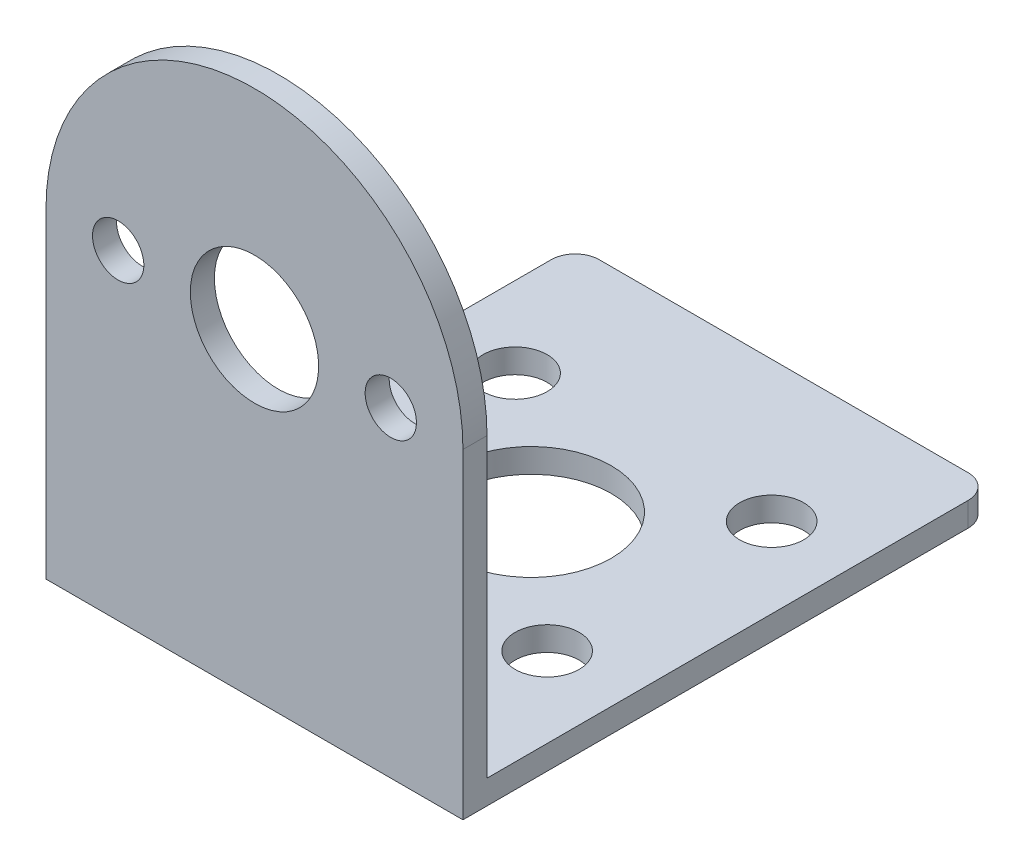
ISO-10303-21;
HEADER;
FILE_DESCRIPTION(('STEP AP214'),'2;1');
FILE_NAME('part.step','',(''),(''),'','','');
FILE_SCHEMA(('AUTOMOTIVE_DESIGN { 1 0 10303 214 1 1 1 1 }'));
ENDSEC;
DATA;
#1=APPLICATION_CONTEXT('core data for automotive mechanical design processes');
#2=APPLICATION_PROTOCOL_DEFINITION('international standard','automotive_design',2000,#1);
#3=PRODUCT_CONTEXT('',#1,'mechanical');
#4=PRODUCT('Part','Part','',(#3));
#5=PRODUCT_RELATED_PRODUCT_CATEGORY('part','',(#4));
#6=PRODUCT_DEFINITION_FORMATION('','',#4);
#7=PRODUCT_DEFINITION_CONTEXT('part definition',#1,'design');
#8=PRODUCT_DEFINITION('design','',#6,#7);
#9=PRODUCT_DEFINITION_SHAPE('','',#8);
#10=(LENGTH_UNIT() NAMED_UNIT(*) SI_UNIT(.MILLI.,.METRE.));
#11=(NAMED_UNIT(*) PLANE_ANGLE_UNIT() SI_UNIT($,.RADIAN.));
#12=(NAMED_UNIT(*) SI_UNIT($,.STERADIAN.) SOLID_ANGLE_UNIT());
#13=UNCERTAINTY_MEASURE_WITH_UNIT(LENGTH_MEASURE(1.E-05),#10,'distance_accuracy_value','');
#14=(GEOMETRIC_REPRESENTATION_CONTEXT(3) GLOBAL_UNCERTAINTY_ASSIGNED_CONTEXT((#13)) GLOBAL_UNIT_ASSIGNED_CONTEXT((#10,
#11,#12)) REPRESENTATION_CONTEXT('',''));
#15=CARTESIAN_POINT('',(0.,0.,0.));
#16=DIRECTION('',(0.,0.,1.));
#17=DIRECTION('',(1.,0.,0.));
#18=AXIS2_PLACEMENT_3D('',#15,#16,#17);
#19=CARTESIAN_POINT('',(13.,20.,0.));
#20=DIRECTION('',(0.,0.,1.));
#21=DIRECTION('',(1.,0.,0.));
#22=AXIS2_PLACEMENT_3D('',#19,#20,#21);
#23=PLANE('',#22);
#24=CARTESIAN_POINT('',(13.,20.,0.));
#25=DIRECTION('',(0.,0.,-1.));
#26=DIRECTION('',(-1.,0.,0.));
#27=AXIS2_PLACEMENT_3D('',#24,#25,#26);
#28=CIRCLE('',#27,4.);
#29=CARTESIAN_POINT('',(9.,20.,0.));
#30=VERTEX_POINT('',#29);
#31=EDGE_CURVE('E128',#30,#30,#28,.T.);
#32=ORIENTED_EDGE('',*,*,#31,.F.);
#33=EDGE_LOOP('',(#32));
#34=FACE_BOUND('',#33,.T.);
#35=CARTESIAN_POINT('',(4.5,20.,0.));
#36=DIRECTION('',(0.,0.,-1.));
#37=DIRECTION('',(-1.,0.,0.));
#38=AXIS2_PLACEMENT_3D('',#35,#36,#37);
#39=CIRCLE('',#38,1.6);
#40=CARTESIAN_POINT('',(2.9,20.,0.));
#41=VERTEX_POINT('',#40);
#42=EDGE_CURVE('E138',#41,#41,#39,.T.);
#43=ORIENTED_EDGE('',*,*,#42,.F.);
#44=EDGE_LOOP('',(#43));
#45=FACE_BOUND('',#44,.T.);
#46=CARTESIAN_POINT('',(21.5,20.,0.));
#47=DIRECTION('',(0.,0.,-1.));
#48=DIRECTION('',(-1.,0.,0.));
#49=AXIS2_PLACEMENT_3D('',#46,#47,#48);
#50=CIRCLE('',#49,1.6);
#51=CARTESIAN_POINT('',(19.9,20.,0.));
#52=VERTEX_POINT('',#51);
#53=EDGE_CURVE('E132',#52,#52,#50,.T.);
#54=ORIENTED_EDGE('',*,*,#53,.F.);
#55=EDGE_LOOP('',(#54));
#56=FACE_BOUND('',#55,.T.);
#57=DIRECTION('',(1.,0.,0.));
#58=VECTOR('',#57,1.);
#59=CARTESIAN_POINT('',(26.,1.5,0.));
#60=LINE('',#59,#58);
#61=CARTESIAN_POINT('',(0.,1.5,0.));
#62=VERTEX_POINT('',#61);
#63=CARTESIAN_POINT('',(26.,1.5,0.));
#64=VERTEX_POINT('',#63);
#65=EDGE_CURVE('E111',#62,#64,#60,.T.);
#66=ORIENTED_EDGE('',*,*,#65,.F.);
#67=DIRECTION('',(0.,-1.,0.));
#68=VECTOR('',#67,1.);
#69=CARTESIAN_POINT('',(0.,0.,0.));
#70=LINE('',#69,#68);
#71=CARTESIAN_POINT('',(0.,20.,0.));
#72=VERTEX_POINT('',#71);
#73=EDGE_CURVE('E114',#72,#62,#70,.T.);
#74=ORIENTED_EDGE('',*,*,#73,.F.);
#75=CARTESIAN_POINT('',(13.,20.,0.));
#76=DIRECTION('',(0.,0.,1.));
#77=DIRECTION('',(1.,0.,0.));
#78=AXIS2_PLACEMENT_3D('',#75,#76,#77);
#79=CIRCLE('',#78,13.);
#80=CARTESIAN_POINT('',(26.,20.,0.));
#81=VERTEX_POINT('',#80);
#82=EDGE_CURVE('E113',#81,#72,#79,.T.);
#83=ORIENTED_EDGE('',*,*,#82,.F.);
#84=DIRECTION('',(0.,1.,0.));
#85=VECTOR('',#84,1.);
#86=CARTESIAN_POINT('',(26.,0.,0.));
#87=LINE('',#86,#85);
#88=EDGE_CURVE('E100',#64,#81,#87,.T.);
#89=ORIENTED_EDGE('',*,*,#88,.F.);
#90=EDGE_LOOP('',(#66,#74,#83,#89));
#91=FACE_BOUND('',#90,.T.);
#92=ADVANCED_FACE('F34',(#34,#45,#56,#91),#23,.F.);
#93=CARTESIAN_POINT('',(0.,0.,1.5));
#94=DIRECTION('',(1.,0.,0.));
#95=DIRECTION('',(0.,0.,-1.));
#96=AXIS2_PLACEMENT_3D('',#93,#94,#95);
#97=PLANE('',#96);
#98=DIRECTION('',(0.,0.,1.));
#99=VECTOR('',#98,1.);
#100=CARTESIAN_POINT('',(0.,1.5,-31.5));
#101=LINE('',#100,#99);
#102=CARTESIAN_POINT('',(0.,1.5,-30.));
#103=VERTEX_POINT('',#102);
#104=EDGE_CURVE('E104',#103,#62,#101,.T.);
#105=ORIENTED_EDGE('',*,*,#104,.F.);
#106=DIRECTION('',(0.,1.,0.));
#107=VECTOR('',#106,1.);
#108=CARTESIAN_POINT('',(0.,0.,-30.));
#109=LINE('',#108,#107);
#110=CARTESIAN_POINT('',(0.,0.,-30.));
#111=VERTEX_POINT('',#110);
#112=EDGE_CURVE('E11',#103,#111,#109,.F.);
#113=ORIENTED_EDGE('',*,*,#112,.T.);
#114=DIRECTION('',(0.,0.,-1.));
#115=VECTOR('',#114,1.);
#116=CARTESIAN_POINT('',(0.,0.,1.5));
#117=LINE('',#116,#115);
#118=CARTESIAN_POINT('',(0.,0.,1.5));
#119=VERTEX_POINT('',#118);
#120=EDGE_CURVE('E164',#119,#111,#117,.T.);
#121=ORIENTED_EDGE('',*,*,#120,.F.);
#122=DIRECTION('',(0.,-1.,0.));
#123=VECTOR('',#122,1.);
#124=CARTESIAN_POINT('',(0.,0.,1.5));
#125=LINE('',#124,#123);
#126=CARTESIAN_POINT('',(0.,20.,1.5));
#127=VERTEX_POINT('',#126);
#128=EDGE_CURVE('E146',#127,#119,#125,.T.);
#129=ORIENTED_EDGE('',*,*,#128,.F.);
#130=DIRECTION('',(0.,0.,-1.));
#131=VECTOR('',#130,1.);
#132=CARTESIAN_POINT('',(0.,20.,1.5));
#133=LINE('',#132,#131);
#134=EDGE_CURVE('E155',#127,#72,#133,.T.);
#135=ORIENTED_EDGE('',*,*,#134,.T.);
#136=ORIENTED_EDGE('',*,*,#73,.T.);
#137=EDGE_LOOP('',(#105,#113,#121,#129,#135,#136));
#138=FACE_BOUND('',#137,.T.);
#139=ADVANCED_FACE('F212',(#138),#97,.F.);
#140=CARTESIAN_POINT('',(0.,0.,1.5));
#141=DIRECTION('',(0.,1.,0.));
#142=DIRECTION('',(0.,0.,1.));
#143=AXIS2_PLACEMENT_3D('',#140,#141,#142);
#144=PLANE('',#143);
#145=CARTESIAN_POINT('',(5.,0.,-22.75));
#146=DIRECTION('',(0.,-1.,0.));
#147=DIRECTION('',(0.,0.,1.));
#148=AXIS2_PLACEMENT_3D('',#145,#146,#147);
#149=CIRCLE('',#148,2.);
#150=CARTESIAN_POINT('',(5.,0.,-20.75));
#151=VERTEX_POINT('',#150);
#152=EDGE_CURVE('E292',#151,#151,#149,.T.);
#153=ORIENTED_EDGE('',*,*,#152,.F.);
#154=EDGE_LOOP('',(#153));
#155=FACE_BOUND('',#154,.T.);
#156=CARTESIAN_POINT('',(13.,0.,-15.75));
#157=DIRECTION('',(0.,-1.,0.));
#158=DIRECTION('',(0.,0.,-1.));
#159=AXIS2_PLACEMENT_3D('',#156,#157,#158);
#160=CIRCLE('',#159,5.);
#161=CARTESIAN_POINT('',(13.,0.,-20.75));
#162=VERTEX_POINT('',#161);
#163=EDGE_CURVE('E287',#162,#162,#160,.T.);
#164=ORIENTED_EDGE('',*,*,#163,.F.);
#165=EDGE_LOOP('',(#164));
#166=FACE_BOUND('',#165,.T.);
#167=CARTESIAN_POINT('',(21.,0.,-22.75));
#168=DIRECTION('',(0.,-1.,0.));
#169=DIRECTION('',(0.,0.,1.));
#170=AXIS2_PLACEMENT_3D('',#167,#168,#169);
#171=CIRCLE('',#170,2.);
#172=CARTESIAN_POINT('',(21.,0.,-20.75));
#173=VERTEX_POINT('',#172);
#174=EDGE_CURVE('E282',#173,#173,#171,.T.);
#175=ORIENTED_EDGE('',*,*,#174,.F.);
#176=EDGE_LOOP('',(#175));
#177=FACE_BOUND('',#176,.T.);
#178=CARTESIAN_POINT('',(21.,0.,-8.75));
#179=DIRECTION('',(0.,-1.,0.));
#180=DIRECTION('',(0.,0.,-1.));
#181=AXIS2_PLACEMENT_3D('',#178,#179,#180);
#182=CIRCLE('',#181,2.);
#183=CARTESIAN_POINT('',(21.,0.,-10.75));
#184=VERTEX_POINT('',#183);
#185=EDGE_CURVE('E275',#184,#184,#182,.T.);
#186=ORIENTED_EDGE('',*,*,#185,.F.);
#187=EDGE_LOOP('',(#186));
#188=FACE_BOUND('',#187,.T.);
#189=CARTESIAN_POINT('',(5.,0.,-8.75));
#190=DIRECTION('',(0.,-1.,0.));
#191=DIRECTION('',(0.,0.,-1.));
#192=AXIS2_PLACEMENT_3D('',#189,#190,#191);
#193=CIRCLE('',#192,2.);
#194=CARTESIAN_POINT('',(5.,0.,-10.75));
#195=VERTEX_POINT('',#194);
#196=EDGE_CURVE('E172',#195,#195,#193,.T.);
#197=ORIENTED_EDGE('',*,*,#196,.F.);
#198=EDGE_LOOP('',(#197));
#199=FACE_BOUND('',#198,.T.);
#200=DIRECTION('',(-1.,0.,0.));
#201=VECTOR('',#200,1.);
#202=CARTESIAN_POINT('',(26.,0.,-31.5));
#203=LINE('',#202,#201);
#204=CARTESIAN_POINT('',(24.5,0.,-31.5));
#205=VERTEX_POINT('',#204);
#206=CARTESIAN_POINT('',(1.5,0.,-31.5));
#207=VERTEX_POINT('',#206);
#208=EDGE_CURVE('E117',#205,#207,#203,.T.);
#209=ORIENTED_EDGE('',*,*,#208,.F.);
#210=CARTESIAN_POINT('',(24.5,0.,-30.));
#211=DIRECTION('',(0.,1.,0.));
#212=DIRECTION('',(0.,0.,1.));
#213=AXIS2_PLACEMENT_3D('',#210,#211,#212);
#214=CIRCLE('',#213,1.5);
#215=CARTESIAN_POINT('',(26.,0.,-30.));
#216=VERTEX_POINT('',#215);
#217=EDGE_CURVE('E187',#205,#216,#214,.F.);
#218=ORIENTED_EDGE('',*,*,#217,.T.);
#219=DIRECTION('',(0.,0.,-1.));
#220=VECTOR('',#219,1.);
#221=CARTESIAN_POINT('',(26.,0.,1.5));
#222=LINE('',#221,#220);
#223=CARTESIAN_POINT('',(26.,0.,1.5));
#224=VERTEX_POINT('',#223);
#225=EDGE_CURVE('E162',#224,#216,#222,.T.);
#226=ORIENTED_EDGE('',*,*,#225,.F.);
#227=DIRECTION('',(1.,0.,0.));
#228=VECTOR('',#227,1.);
#229=CARTESIAN_POINT('',(0.,0.,1.5));
#230=LINE('',#229,#228);
#231=EDGE_CURVE('E149',#119,#224,#230,.T.);
#232=ORIENTED_EDGE('',*,*,#231,.F.);
#233=ORIENTED_EDGE('',*,*,#120,.T.);
#234=CARTESIAN_POINT('',(1.5,0.,-30.));
#235=DIRECTION('',(0.,1.,0.));
#236=DIRECTION('',(0.,0.,1.));
#237=AXIS2_PLACEMENT_3D('',#234,#235,#236);
#238=CIRCLE('',#237,1.5);
#239=EDGE_CURVE('E185',#111,#207,#238,.F.);
#240=ORIENTED_EDGE('',*,*,#239,.T.);
#241=EDGE_LOOP('',(#209,#218,#226,#232,#233,#240));
#242=FACE_BOUND('',#241,.T.);
#243=ADVANCED_FACE('F200',(#155,#166,#177,#188,#199,#242),#144,.F.);
#244=CARTESIAN_POINT('',(26.,0.,1.5));
#245=DIRECTION('',(-1.,0.,0.));
#246=DIRECTION('',(0.,0.,1.));
#247=AXIS2_PLACEMENT_3D('',#244,#245,#246);
#248=PLANE('',#247);
#249=ORIENTED_EDGE('',*,*,#225,.T.);
#250=DIRECTION('',(0.,-1.,0.));
#251=VECTOR('',#250,1.);
#252=CARTESIAN_POINT('',(26.,0.,-30.));
#253=LINE('',#252,#251);
#254=CARTESIAN_POINT('',(26.,1.5,-30.));
#255=VERTEX_POINT('',#254);
#256=EDGE_CURVE('E57',#216,#255,#253,.F.);
#257=ORIENTED_EDGE('',*,*,#256,.T.);
#258=DIRECTION('',(0.,0.,1.));
#259=VECTOR('',#258,1.);
#260=CARTESIAN_POINT('',(26.,1.5,-31.5));
#261=LINE('',#260,#259);
#262=EDGE_CURVE('E96',#255,#64,#261,.T.);
#263=ORIENTED_EDGE('',*,*,#262,.T.);
#264=ORIENTED_EDGE('',*,*,#88,.T.);
#265=DIRECTION('',(0.,0.,-1.));
#266=VECTOR('',#265,1.);
#267=CARTESIAN_POINT('',(26.,20.,1.5));
#268=LINE('',#267,#266);
#269=CARTESIAN_POINT('',(26.,20.,1.5));
#270=VERTEX_POINT('',#269);
#271=EDGE_CURVE('E160',#270,#81,#268,.T.);
#272=ORIENTED_EDGE('',*,*,#271,.F.);
#273=DIRECTION('',(0.,1.,0.));
#274=VECTOR('',#273,1.);
#275=CARTESIAN_POINT('',(26.,0.,1.5));
#276=LINE('',#275,#274);
#277=EDGE_CURVE('E151',#224,#270,#276,.T.);
#278=ORIENTED_EDGE('',*,*,#277,.F.);
#279=EDGE_LOOP('',(#249,#257,#263,#264,#272,#278));
#280=FACE_BOUND('',#279,.T.);
#281=ADVANCED_FACE('F98',(#280),#248,.F.);
#282=CARTESIAN_POINT('',(13.,20.,1.5));
#283=DIRECTION('',(0.,0.,-1.));
#284=DIRECTION('',(-1.,0.,0.));
#285=AXIS2_PLACEMENT_3D('',#282,#283,#284);
#286=CYLINDRICAL_SURFACE('',#285,13.);
#287=ORIENTED_EDGE('',*,*,#82,.T.);
#288=ORIENTED_EDGE('',*,*,#134,.F.);
#289=CARTESIAN_POINT('',(13.,20.,1.5));
#290=DIRECTION('',(0.,0.,1.));
#291=DIRECTION('',(1.,0.,0.));
#292=AXIS2_PLACEMENT_3D('',#289,#290,#291);
#293=CIRCLE('',#292,13.);
#294=EDGE_CURVE('E153',#270,#127,#293,.T.);
#295=ORIENTED_EDGE('',*,*,#294,.F.);
#296=ORIENTED_EDGE('',*,*,#271,.T.);
#297=EDGE_LOOP('',(#287,#288,#295,#296));
#298=FACE_BOUND('',#297,.T.);
#299=ADVANCED_FACE('F214',(#298),#286,.T.);
#300=CARTESIAN_POINT('',(13.,20.,1.5));
#301=DIRECTION('',(0.,0.,1.));
#302=DIRECTION('',(1.,0.,0.));
#303=AXIS2_PLACEMENT_3D('',#300,#301,#302);
#304=PLANE('',#303);
#305=CARTESIAN_POINT('',(21.5,20.,1.5));
#306=DIRECTION('',(0.,0.,-1.));
#307=DIRECTION('',(-1.,0.,0.));
#308=AXIS2_PLACEMENT_3D('',#305,#306,#307);
#309=CIRCLE('',#308,1.6);
#310=CARTESIAN_POINT('',(19.9,20.,1.5));
#311=VERTEX_POINT('',#310);
#312=EDGE_CURVE('E129',#311,#311,#309,.T.);
#313=ORIENTED_EDGE('',*,*,#312,.T.);
#314=EDGE_LOOP('',(#313));
#315=FACE_BOUND('',#314,.T.);
#316=CARTESIAN_POINT('',(4.5,20.,1.5));
#317=DIRECTION('',(0.,0.,-1.));
#318=DIRECTION('',(-1.,0.,0.));
#319=AXIS2_PLACEMENT_3D('',#316,#317,#318);
#320=CIRCLE('',#319,1.6);
#321=CARTESIAN_POINT('',(2.9,20.,1.5));
#322=VERTEX_POINT('',#321);
#323=EDGE_CURVE('E135',#322,#322,#320,.T.);
#324=ORIENTED_EDGE('',*,*,#323,.T.);
#325=EDGE_LOOP('',(#324));
#326=FACE_BOUND('',#325,.T.);
#327=CARTESIAN_POINT('',(13.,20.,1.5));
#328=DIRECTION('',(0.,0.,-1.));
#329=DIRECTION('',(-1.,0.,0.));
#330=AXIS2_PLACEMENT_3D('',#327,#328,#329);
#331=CIRCLE('',#330,4.);
#332=CARTESIAN_POINT('',(9.,20.,1.5));
#333=VERTEX_POINT('',#332);
#334=EDGE_CURVE('E141',#333,#333,#331,.T.);
#335=ORIENTED_EDGE('',*,*,#334,.T.);
#336=EDGE_LOOP('',(#335));
#337=FACE_BOUND('',#336,.T.);
#338=ORIENTED_EDGE('',*,*,#128,.T.);
#339=ORIENTED_EDGE('',*,*,#231,.T.);
#340=ORIENTED_EDGE('',*,*,#277,.T.);
#341=ORIENTED_EDGE('',*,*,#294,.T.);
#342=EDGE_LOOP('',(#338,#339,#340,#341));
#343=FACE_BOUND('',#342,.T.);
#344=ADVANCED_FACE('F204',(#315,#326,#337,#343),#304,.T.);
#345=CARTESIAN_POINT('',(13.,20.,1.5));
#346=DIRECTION('',(0.,0.,-1.));
#347=DIRECTION('',(-1.,0.,0.));
#348=AXIS2_PLACEMENT_3D('',#345,#346,#347);
#349=CYLINDRICAL_SURFACE('',#348,4.);
#350=ORIENTED_EDGE('',*,*,#334,.F.);
#351=EDGE_LOOP('',(#350));
#352=FACE_BOUND('',#351,.T.);
#353=ORIENTED_EDGE('',*,*,#31,.T.);
#354=EDGE_LOOP('',(#353));
#355=FACE_BOUND('',#354,.T.);
#356=ADVANCED_FACE('F221',(#352,#355),#349,.F.);
#357=CARTESIAN_POINT('',(4.5,20.,1.5));
#358=DIRECTION('',(0.,0.,-1.));
#359=DIRECTION('',(-1.,0.,0.));
#360=AXIS2_PLACEMENT_3D('',#357,#358,#359);
#361=CYLINDRICAL_SURFACE('',#360,1.6);
#362=ORIENTED_EDGE('',*,*,#323,.F.);
#363=EDGE_LOOP('',(#362));
#364=FACE_BOUND('',#363,.T.);
#365=ORIENTED_EDGE('',*,*,#42,.T.);
#366=EDGE_LOOP('',(#365));
#367=FACE_BOUND('',#366,.T.);
#368=ADVANCED_FACE('F237',(#364,#367),#361,.F.);
#369=CARTESIAN_POINT('',(21.5,20.,1.5));
#370=DIRECTION('',(0.,0.,-1.));
#371=DIRECTION('',(-1.,0.,0.));
#372=AXIS2_PLACEMENT_3D('',#369,#370,#371);
#373=CYLINDRICAL_SURFACE('',#372,1.6);
#374=ORIENTED_EDGE('',*,*,#312,.F.);
#375=EDGE_LOOP('',(#374));
#376=FACE_BOUND('',#375,.T.);
#377=ORIENTED_EDGE('',*,*,#53,.T.);
#378=EDGE_LOOP('',(#377));
#379=FACE_BOUND('',#378,.T.);
#380=ADVANCED_FACE('F241',(#376,#379),#373,.F.);
#381=CARTESIAN_POINT('',(26.,1.5,-31.5));
#382=DIRECTION('',(0.,-1.,0.));
#383=DIRECTION('',(1.,0.,0.));
#384=AXIS2_PLACEMENT_3D('',#381,#382,#383);
#385=PLANE('',#384);
#386=CARTESIAN_POINT('',(5.,1.5,-22.75));
#387=DIRECTION('',(0.,-1.,0.));
#388=DIRECTION('',(1.,0.,0.));
#389=AXIS2_PLACEMENT_3D('',#386,#387,#388);
#390=CIRCLE('',#389,2.);
#391=CARTESIAN_POINT('',(7.,1.5,-22.75));
#392=VERTEX_POINT('',#391);
#393=EDGE_CURVE('E118',#392,#392,#390,.T.);
#394=ORIENTED_EDGE('',*,*,#393,.T.);
#395=EDGE_LOOP('',(#394));
#396=FACE_BOUND('',#395,.T.);
#397=CARTESIAN_POINT('',(13.,1.5,-15.75));
#398=DIRECTION('',(0.,-1.,0.));
#399=DIRECTION('',(1.,0.,0.));
#400=AXIS2_PLACEMENT_3D('',#397,#398,#399);
#401=CIRCLE('',#400,5.);
#402=CARTESIAN_POINT('',(18.,1.5,-15.75));
#403=VERTEX_POINT('',#402);
#404=EDGE_CURVE('E123',#403,#403,#401,.T.);
#405=ORIENTED_EDGE('',*,*,#404,.T.);
#406=EDGE_LOOP('',(#405));
#407=FACE_BOUND('',#406,.T.);
#408=CARTESIAN_POINT('',(21.,1.5,-22.75));
#409=DIRECTION('',(0.,-1.,0.));
#410=DIRECTION('',(1.,0.,0.));
#411=AXIS2_PLACEMENT_3D('',#408,#409,#410);
#412=CIRCLE('',#411,2.);
#413=CARTESIAN_POINT('',(23.,1.5,-22.75));
#414=VERTEX_POINT('',#413);
#415=EDGE_CURVE('E175',#414,#414,#412,.T.);
#416=ORIENTED_EDGE('',*,*,#415,.T.);
#417=EDGE_LOOP('',(#416));
#418=FACE_BOUND('',#417,.T.);
#419=CARTESIAN_POINT('',(21.,1.5,-8.75));
#420=DIRECTION('',(0.,-1.,0.));
#421=DIRECTION('',(1.,0.,0.));
#422=AXIS2_PLACEMENT_3D('',#419,#420,#421);
#423=CIRCLE('',#422,2.);
#424=CARTESIAN_POINT('',(23.,1.5,-8.75));
#425=VERTEX_POINT('',#424);
#426=EDGE_CURVE('E171',#425,#425,#423,.T.);
#427=ORIENTED_EDGE('',*,*,#426,.T.);
#428=EDGE_LOOP('',(#427));
#429=FACE_BOUND('',#428,.T.);
#430=CARTESIAN_POINT('',(5.,1.5,-8.75));
#431=DIRECTION('',(0.,-1.,0.));
#432=DIRECTION('',(1.,0.,0.));
#433=AXIS2_PLACEMENT_3D('',#430,#431,#432);
#434=CIRCLE('',#433,2.);
#435=CARTESIAN_POINT('',(7.,1.5,-8.75));
#436=VERTEX_POINT('',#435);
#437=EDGE_CURVE('E168',#436,#436,#434,.T.);
#438=ORIENTED_EDGE('',*,*,#437,.T.);
#439=EDGE_LOOP('',(#438));
#440=FACE_BOUND('',#439,.T.);
#441=ORIENTED_EDGE('',*,*,#262,.F.);
#442=CARTESIAN_POINT('',(24.5,1.5,-30.));
#443=DIRECTION('',(0.,-1.,0.));
#444=DIRECTION('',(1.,0.,0.));
#445=AXIS2_PLACEMENT_3D('',#442,#443,#444);
#446=CIRCLE('',#445,1.5);
#447=CARTESIAN_POINT('',(24.5,1.5,-31.5));
#448=VERTEX_POINT('',#447);
#449=EDGE_CURVE('E42',#255,#448,#446,.F.);
#450=ORIENTED_EDGE('',*,*,#449,.T.);
#451=DIRECTION('',(1.,0.,0.));
#452=VECTOR('',#451,1.);
#453=CARTESIAN_POINT('',(26.,1.5,-31.5));
#454=LINE('',#453,#452);
#455=CARTESIAN_POINT('',(1.5,1.5,-31.5));
#456=VERTEX_POINT('',#455);
#457=EDGE_CURVE('E105',#456,#448,#454,.T.);
#458=ORIENTED_EDGE('',*,*,#457,.F.);
#459=CARTESIAN_POINT('',(1.5,1.5,-30.));
#460=DIRECTION('',(0.,-1.,0.));
#461=DIRECTION('',(1.,0.,0.));
#462=AXIS2_PLACEMENT_3D('',#459,#460,#461);
#463=CIRCLE('',#462,1.5);
#464=EDGE_CURVE('E49',#456,#103,#463,.F.);
#465=ORIENTED_EDGE('',*,*,#464,.T.);
#466=ORIENTED_EDGE('',*,*,#104,.T.);
#467=ORIENTED_EDGE('',*,*,#65,.T.);
#468=EDGE_LOOP('',(#441,#450,#458,#465,#466,#467));
#469=FACE_BOUND('',#468,.T.);
#470=ADVANCED_FACE('F116',(#396,#407,#418,#429,#440,#469),#385,.F.);
#471=CARTESIAN_POINT('',(0.,0.,-31.5));
#472=DIRECTION('',(0.,0.,1.));
#473=DIRECTION('',(1.,0.,0.));
#474=AXIS2_PLACEMENT_3D('',#471,#472,#473);
#475=PLANE('',#474);
#476=ORIENTED_EDGE('',*,*,#457,.T.);
#477=DIRECTION('',(0.,-1.,0.));
#478=VECTOR('',#477,1.);
#479=CARTESIAN_POINT('',(24.5,0.,-31.5));
#480=LINE('',#479,#478);
#481=EDGE_CURVE('E182',#448,#205,#480,.T.);
#482=ORIENTED_EDGE('',*,*,#481,.T.);
#483=ORIENTED_EDGE('',*,*,#208,.T.);
#484=DIRECTION('',(0.,1.,0.));
#485=VECTOR('',#484,1.);
#486=CARTESIAN_POINT('',(1.5,0.,-31.5));
#487=LINE('',#486,#485);
#488=EDGE_CURVE('E167',#207,#456,#487,.T.);
#489=ORIENTED_EDGE('',*,*,#488,.T.);
#490=EDGE_LOOP('',(#476,#482,#483,#489));
#491=FACE_BOUND('',#490,.T.);
#492=ADVANCED_FACE('F194',(#491),#475,.F.);
#493=CARTESIAN_POINT('',(5.,33.,-8.75));
#494=DIRECTION('',(0.,-1.,0.));
#495=DIRECTION('',(0.,0.,-1.));
#496=AXIS2_PLACEMENT_3D('',#493,#494,#495);
#497=CYLINDRICAL_SURFACE('',#496,2.);
#498=ORIENTED_EDGE('',*,*,#196,.T.);
#499=EDGE_LOOP('',(#498));
#500=FACE_BOUND('',#499,.T.);
#501=ORIENTED_EDGE('',*,*,#437,.F.);
#502=EDGE_LOOP('',(#501));
#503=FACE_BOUND('',#502,.T.);
#504=ADVANCED_FACE('F251',(#500,#503),#497,.F.);
#505=CARTESIAN_POINT('',(21.,33.,-8.75));
#506=DIRECTION('',(0.,-1.,0.));
#507=DIRECTION('',(0.,0.,-1.));
#508=AXIS2_PLACEMENT_3D('',#505,#506,#507);
#509=CYLINDRICAL_SURFACE('',#508,2.);
#510=ORIENTED_EDGE('',*,*,#185,.T.);
#511=EDGE_LOOP('',(#510));
#512=FACE_BOUND('',#511,.T.);
#513=ORIENTED_EDGE('',*,*,#426,.F.);
#514=EDGE_LOOP('',(#513));
#515=FACE_BOUND('',#514,.T.);
#516=ADVANCED_FACE('F254',(#512,#515),#509,.F.);
#517=CARTESIAN_POINT('',(21.,33.,-22.75));
#518=DIRECTION('',(0.,-1.,0.));
#519=DIRECTION('',(0.,0.,-1.));
#520=AXIS2_PLACEMENT_3D('',#517,#518,#519);
#521=CYLINDRICAL_SURFACE('',#520,2.);
#522=ORIENTED_EDGE('',*,*,#174,.T.);
#523=EDGE_LOOP('',(#522));
#524=FACE_BOUND('',#523,.T.);
#525=ORIENTED_EDGE('',*,*,#415,.F.);
#526=EDGE_LOOP('',(#525));
#527=FACE_BOUND('',#526,.T.);
#528=ADVANCED_FACE('F263',(#524,#527),#521,.F.);
#529=CARTESIAN_POINT('',(13.,33.,-15.75));
#530=DIRECTION('',(0.,-1.,0.));
#531=DIRECTION('',(0.,0.,-1.));
#532=AXIS2_PLACEMENT_3D('',#529,#530,#531);
#533=CYLINDRICAL_SURFACE('',#532,5.);
#534=ORIENTED_EDGE('',*,*,#163,.T.);
#535=EDGE_LOOP('',(#534));
#536=FACE_BOUND('',#535,.T.);
#537=ORIENTED_EDGE('',*,*,#404,.F.);
#538=EDGE_LOOP('',(#537));
#539=FACE_BOUND('',#538,.T.);
#540=ADVANCED_FACE('F259',(#536,#539),#533,.F.);
#541=CARTESIAN_POINT('',(5.,33.,-22.75));
#542=DIRECTION('',(0.,-1.,0.));
#543=DIRECTION('',(0.,0.,-1.));
#544=AXIS2_PLACEMENT_3D('',#541,#542,#543);
#545=CYLINDRICAL_SURFACE('',#544,2.);
#546=ORIENTED_EDGE('',*,*,#152,.T.);
#547=EDGE_LOOP('',(#546));
#548=FACE_BOUND('',#547,.T.);
#549=ORIENTED_EDGE('',*,*,#393,.F.);
#550=EDGE_LOOP('',(#549));
#551=FACE_BOUND('',#550,.T.);
#552=ADVANCED_FACE('F256',(#548,#551),#545,.F.);
#553=CARTESIAN_POINT('',(24.5,0.,-30.));
#554=DIRECTION('',(0.,-1.,0.));
#555=DIRECTION('',(0.,0.,-1.));
#556=AXIS2_PLACEMENT_3D('',#553,#554,#555);
#557=CYLINDRICAL_SURFACE('',#556,1.5);
#558=ORIENTED_EDGE('',*,*,#449,.F.);
#559=ORIENTED_EDGE('',*,*,#256,.F.);
#560=ORIENTED_EDGE('',*,*,#217,.F.);
#561=ORIENTED_EDGE('',*,*,#481,.F.);
#562=EDGE_LOOP('',(#558,#559,#560,#561));
#563=FACE_BOUND('',#562,.T.);
#564=ADVANCED_FACE('F197',(#563),#557,.T.);
#565=CARTESIAN_POINT('',(1.5,0.,-30.));
#566=DIRECTION('',(0.,1.,0.));
#567=DIRECTION('',(0.,0.,1.));
#568=AXIS2_PLACEMENT_3D('',#565,#566,#567);
#569=CYLINDRICAL_SURFACE('',#568,1.5);
#570=ORIENTED_EDGE('',*,*,#239,.F.);
#571=ORIENTED_EDGE('',*,*,#112,.F.);
#572=ORIENTED_EDGE('',*,*,#464,.F.);
#573=ORIENTED_EDGE('',*,*,#488,.F.);
#574=EDGE_LOOP('',(#570,#571,#572,#573));
#575=FACE_BOUND('',#574,.T.);
#576=ADVANCED_FACE('F36',(#575),#569,.T.);
#577=CLOSED_SHELL('',(#92,#139,#243,#281,#299,#344,#356,#368,#380,#470,#492,#504,#516,#528,#540,
#552,#564,#576));
#578=MANIFOLD_SOLID_BREP('B2',#577);
#579=ADVANCED_BREP_SHAPE_REPRESENTATION('',(#18,#578),#14);
#580=SHAPE_DEFINITION_REPRESENTATION(#9,#579);
ENDSEC;
END-ISO-10303-21;
